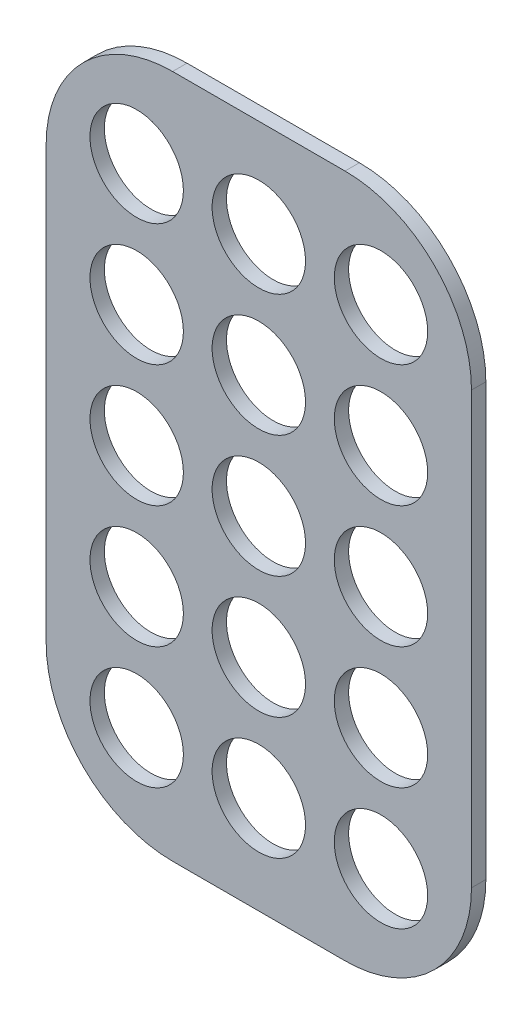
ISO-10303-21;
HEADER;
FILE_DESCRIPTION(('STEP AP214'),'2;1');
FILE_NAME('part.step','',(''),(''),'','','');
FILE_SCHEMA(('AUTOMOTIVE_DESIGN { 1 0 10303 214 1 1 1 1 }'));
ENDSEC;
DATA;
#1=APPLICATION_CONTEXT('core data for automotive mechanical design processes');
#2=APPLICATION_PROTOCOL_DEFINITION('international standard','automotive_design',2000,#1);
#3=PRODUCT_CONTEXT('',#1,'mechanical');
#4=PRODUCT('Part','Part','',(#3));
#5=PRODUCT_RELATED_PRODUCT_CATEGORY('part','',(#4));
#6=PRODUCT_DEFINITION_FORMATION('','',#4);
#7=PRODUCT_DEFINITION_CONTEXT('part definition',#1,'design');
#8=PRODUCT_DEFINITION('design','',#6,#7);
#9=PRODUCT_DEFINITION_SHAPE('','',#8);
#10=(LENGTH_UNIT() NAMED_UNIT(*) SI_UNIT(.MILLI.,.METRE.));
#11=(NAMED_UNIT(*) PLANE_ANGLE_UNIT() SI_UNIT($,.RADIAN.));
#12=(NAMED_UNIT(*) SI_UNIT($,.STERADIAN.) SOLID_ANGLE_UNIT());
#13=UNCERTAINTY_MEASURE_WITH_UNIT(LENGTH_MEASURE(1.E-05),#10,'distance_accuracy_value','');
#14=(GEOMETRIC_REPRESENTATION_CONTEXT(3) GLOBAL_UNCERTAINTY_ASSIGNED_CONTEXT((#13)) GLOBAL_UNIT_ASSIGNED_CONTEXT((#10,
#11,#12)) REPRESENTATION_CONTEXT('',''));
#15=CARTESIAN_POINT('',(0.,0.,0.));
#16=DIRECTION('',(0.,0.,1.));
#17=DIRECTION('',(1.,0.,0.));
#18=AXIS2_PLACEMENT_3D('',#15,#16,#17);
#19=CARTESIAN_POINT('',(-59.2,-47.6,2.));
#20=DIRECTION('',(0.,1.,0.));
#21=DIRECTION('',(-1.,0.,0.));
#22=AXIS2_PLACEMENT_3D('',#19,#20,#21);
#23=PLANE('',#22);
#24=DIRECTION('',(1.,0.,0.));
#25=VECTOR('',#24,1.);
#26=CARTESIAN_POINT('',(-59.2,-47.6,2.));
#27=LINE('',#26,#25);
#28=CARTESIAN_POINT('',(-41.6,-47.6,2.));
#29=VERTEX_POINT('',#28);
#30=CARTESIAN_POINT('',(-17.6,-47.6,2.));
#31=VERTEX_POINT('',#30);
#32=EDGE_CURVE('E125',#29,#31,#27,.T.);
#33=ORIENTED_EDGE('',*,*,#32,.F.);
#34=DIRECTION('',(0.,0.,-1.));
#35=VECTOR('',#34,1.);
#36=CARTESIAN_POINT('',(-41.6,-47.6,2.));
#37=LINE('',#36,#35);
#38=CARTESIAN_POINT('',(-41.6,-47.6,0.));
#39=VERTEX_POINT('',#38);
#40=EDGE_CURVE('E110',#29,#39,#37,.T.);
#41=ORIENTED_EDGE('',*,*,#40,.T.);
#42=DIRECTION('',(1.,0.,0.));
#43=VECTOR('',#42,1.);
#44=CARTESIAN_POINT('',(-59.2,-47.6,0.));
#45=LINE('',#44,#43);
#46=CARTESIAN_POINT('',(-17.6,-47.6,0.));
#47=VERTEX_POINT('',#46);
#48=EDGE_CURVE('E122',#39,#47,#45,.T.);
#49=ORIENTED_EDGE('',*,*,#48,.T.);
#50=DIRECTION('',(0.,0.,-1.));
#51=VECTOR('',#50,1.);
#52=CARTESIAN_POINT('',(-17.6,-47.6,2.));
#53=LINE('',#52,#51);
#54=EDGE_CURVE('E127',#47,#31,#53,.F.);
#55=ORIENTED_EDGE('',*,*,#54,.T.);
#56=EDGE_LOOP('',(#33,#41,#49,#55));
#57=FACE_BOUND('',#56,.T.);
#58=ADVANCED_FACE('F41',(#57),#23,.F.);
#59=CARTESIAN_POINT('',(0.,-47.6,2.));
#60=DIRECTION('',(-1.,0.,0.));
#61=DIRECTION('',(0.,0.,1.));
#62=AXIS2_PLACEMENT_3D('',#59,#60,#61);
#63=PLANE('',#62);
#64=DIRECTION('',(0.,1.,0.));
#65=VECTOR('',#64,1.);
#66=CARTESIAN_POINT('',(0.,-47.6,2.));
#67=LINE('',#66,#65);
#68=CARTESIAN_POINT('',(0.,-30.,2.));
#69=VERTEX_POINT('',#68);
#70=CARTESIAN_POINT('',(0.,30.,2.));
#71=VERTEX_POINT('',#70);
#72=EDGE_CURVE('E180',#69,#71,#67,.T.);
#73=ORIENTED_EDGE('',*,*,#72,.F.);
#74=DIRECTION('',(0.,0.,-1.));
#75=VECTOR('',#74,1.);
#76=CARTESIAN_POINT('',(0.,-30.,2.));
#77=LINE('',#76,#75);
#78=CARTESIAN_POINT('',(0.,-30.,0.));
#79=VERTEX_POINT('',#78);
#80=EDGE_CURVE('E164',#69,#79,#77,.T.);
#81=ORIENTED_EDGE('',*,*,#80,.T.);
#82=DIRECTION('',(0.,1.,0.));
#83=VECTOR('',#82,1.);
#84=CARTESIAN_POINT('',(0.,-47.6,0.));
#85=LINE('',#84,#83);
#86=CARTESIAN_POINT('',(0.,30.,0.));
#87=VERTEX_POINT('',#86);
#88=EDGE_CURVE('E131',#79,#87,#85,.T.);
#89=ORIENTED_EDGE('',*,*,#88,.T.);
#90=DIRECTION('',(0.,0.,-1.));
#91=VECTOR('',#90,1.);
#92=CARTESIAN_POINT('',(0.,30.,2.));
#93=LINE('',#92,#91);
#94=EDGE_CURVE('E162',#87,#71,#93,.F.);
#95=ORIENTED_EDGE('',*,*,#94,.T.);
#96=EDGE_LOOP('',(#73,#81,#89,#95));
#97=FACE_BOUND('',#96,.T.);
#98=ADVANCED_FACE('F290',(#97),#63,.F.);
#99=CARTESIAN_POINT('',(-59.2,47.6,2.));
#100=DIRECTION('',(0.,-1.,0.));
#101=DIRECTION('',(1.,0.,0.));
#102=AXIS2_PLACEMENT_3D('',#99,#100,#101);
#103=PLANE('',#102);
#104=DIRECTION('',(-1.,0.,0.));
#105=VECTOR('',#104,1.);
#106=CARTESIAN_POINT('',(-59.2,47.6,0.));
#107=LINE('',#106,#105);
#108=CARTESIAN_POINT('',(-17.6,47.6,0.));
#109=VERTEX_POINT('',#108);
#110=CARTESIAN_POINT('',(-41.6,47.6,0.));
#111=VERTEX_POINT('',#110);
#112=EDGE_CURVE('E135',#109,#111,#107,.T.);
#113=ORIENTED_EDGE('',*,*,#112,.T.);
#114=DIRECTION('',(0.,0.,-1.));
#115=VECTOR('',#114,1.);
#116=CARTESIAN_POINT('',(-41.6,47.6,2.));
#117=LINE('',#116,#115);
#118=CARTESIAN_POINT('',(-41.6,47.6,2.));
#119=VERTEX_POINT('',#118);
#120=EDGE_CURVE('E11',#111,#119,#117,.F.);
#121=ORIENTED_EDGE('',*,*,#120,.T.);
#122=DIRECTION('',(-1.,0.,0.));
#123=VECTOR('',#122,1.);
#124=CARTESIAN_POINT('',(-59.2,47.6,2.));
#125=LINE('',#124,#123);
#126=CARTESIAN_POINT('',(-17.6,47.6,2.));
#127=VERTEX_POINT('',#126);
#128=EDGE_CURVE('E170',#127,#119,#125,.T.);
#129=ORIENTED_EDGE('',*,*,#128,.F.);
#130=DIRECTION('',(0.,0.,-1.));
#131=VECTOR('',#130,1.);
#132=CARTESIAN_POINT('',(-17.6,47.6,2.));
#133=LINE('',#132,#131);
#134=EDGE_CURVE('E49',#127,#109,#133,.T.);
#135=ORIENTED_EDGE('',*,*,#134,.T.);
#136=EDGE_LOOP('',(#113,#121,#129,#135));
#137=FACE_BOUND('',#136,.T.);
#138=ADVANCED_FACE('F169',(#137),#103,.F.);
#139=CARTESIAN_POINT('',(-59.2,-47.6,2.));
#140=DIRECTION('',(1.,0.,0.));
#141=DIRECTION('',(0.,0.,-1.));
#142=AXIS2_PLACEMENT_3D('',#139,#140,#141);
#143=PLANE('',#142);
#144=DIRECTION('',(0.,-1.,0.));
#145=VECTOR('',#144,1.);
#146=CARTESIAN_POINT('',(-59.2,-47.6,0.));
#147=LINE('',#146,#145);
#148=CARTESIAN_POINT('',(-59.2,30.,0.));
#149=VERTEX_POINT('',#148);
#150=CARTESIAN_POINT('',(-59.2,-30.,0.));
#151=VERTEX_POINT('',#150);
#152=EDGE_CURVE('E145',#149,#151,#147,.T.);
#153=ORIENTED_EDGE('',*,*,#152,.T.);
#154=DIRECTION('',(0.,0.,-1.));
#155=VECTOR('',#154,1.);
#156=CARTESIAN_POINT('',(-59.2,-30.,2.));
#157=LINE('',#156,#155);
#158=CARTESIAN_POINT('',(-59.2,-30.,2.));
#159=VERTEX_POINT('',#158);
#160=EDGE_CURVE('E111',#151,#159,#157,.F.);
#161=ORIENTED_EDGE('',*,*,#160,.T.);
#162=DIRECTION('',(0.,-1.,0.));
#163=VECTOR('',#162,1.);
#164=CARTESIAN_POINT('',(-59.2,-47.6,2.));
#165=LINE('',#164,#163);
#166=CARTESIAN_POINT('',(-59.2,30.,2.));
#167=VERTEX_POINT('',#166);
#168=EDGE_CURVE('E141',#167,#159,#165,.T.);
#169=ORIENTED_EDGE('',*,*,#168,.F.);
#170=DIRECTION('',(0.,0.,-1.));
#171=VECTOR('',#170,1.);
#172=CARTESIAN_POINT('',(-59.2,30.,2.));
#173=LINE('',#172,#171);
#174=EDGE_CURVE('E116',#167,#149,#173,.T.);
#175=ORIENTED_EDGE('',*,*,#174,.T.);
#176=EDGE_LOOP('',(#153,#161,#169,#175));
#177=FACE_BOUND('',#176,.T.);
#178=ADVANCED_FACE('F178',(#177),#143,.F.);
#179=CARTESIAN_POINT('',(0.,0.,2.));
#180=DIRECTION('',(0.,0.,1.));
#181=DIRECTION('',(1.,0.,0.));
#182=AXIS2_PLACEMENT_3D('',#179,#180,#181);
#183=PLANE('',#182);
#184=CARTESIAN_POINT('',(-29.6000000000001,34.,2.));
#185=DIRECTION('',(0.,0.,1.));
#186=DIRECTION('',(1.,0.,0.));
#187=AXIS2_PLACEMENT_3D('',#184,#185,#186);
#188=CIRCLE('',#187,6.5);
#189=CARTESIAN_POINT('',(-23.1000000000001,34.,2.));
#190=VERTEX_POINT('',#189);
#191=EDGE_CURVE('E132',#190,#190,#188,.T.);
#192=ORIENTED_EDGE('',*,*,#191,.F.);
#193=EDGE_LOOP('',(#192));
#194=FACE_BOUND('',#193,.T.);
#195=CARTESIAN_POINT('',(-12.6000000000001,17.,2.));
#196=DIRECTION('',(0.,0.,1.));
#197=DIRECTION('',(1.,0.,0.));
#198=AXIS2_PLACEMENT_3D('',#195,#196,#197);
#199=CIRCLE('',#198,6.5);
#200=CARTESIAN_POINT('',(-6.10000000000006,17.,2.));
#201=VERTEX_POINT('',#200);
#202=EDGE_CURVE('E138',#201,#201,#199,.T.);
#203=ORIENTED_EDGE('',*,*,#202,.F.);
#204=EDGE_LOOP('',(#203));
#205=FACE_BOUND('',#204,.T.);
#206=CARTESIAN_POINT('',(-46.6000000000001,16.9999999999999,2.));
#207=DIRECTION('',(0.,0.,1.));
#208=DIRECTION('',(1.,0.,0.));
#209=AXIS2_PLACEMENT_3D('',#206,#207,#208);
#210=CIRCLE('',#209,6.5);
#211=CARTESIAN_POINT('',(-40.1000000000001,16.9999999999999,2.));
#212=VERTEX_POINT('',#211);
#213=EDGE_CURVE('E186',#212,#212,#210,.T.);
#214=ORIENTED_EDGE('',*,*,#213,.F.);
#215=EDGE_LOOP('',(#214));
#216=FACE_BOUND('',#215,.T.);
#217=CARTESIAN_POINT('',(-29.6000000000001,17.,2.));
#218=DIRECTION('',(0.,0.,1.));
#219=DIRECTION('',(1.,0.,0.));
#220=AXIS2_PLACEMENT_3D('',#217,#218,#219);
#221=CIRCLE('',#220,6.5);
#222=CARTESIAN_POINT('',(-23.1000000000001,17.,2.));
#223=VERTEX_POINT('',#222);
#224=EDGE_CURVE('E189',#223,#223,#221,.T.);
#225=ORIENTED_EDGE('',*,*,#224,.F.);
#226=EDGE_LOOP('',(#225));
#227=FACE_BOUND('',#226,.T.);
#228=CARTESIAN_POINT('',(-46.6000000000001,33.9999999999999,2.));
#229=DIRECTION('',(0.,0.,1.));
#230=DIRECTION('',(1.,0.,0.));
#231=AXIS2_PLACEMENT_3D('',#228,#229,#230);
#232=CIRCLE('',#231,6.5);
#233=CARTESIAN_POINT('',(-40.1000000000001,33.9999999999999,2.));
#234=VERTEX_POINT('',#233);
#235=EDGE_CURVE('E192',#234,#234,#232,.T.);
#236=ORIENTED_EDGE('',*,*,#235,.F.);
#237=EDGE_LOOP('',(#236));
#238=FACE_BOUND('',#237,.T.);
#239=CARTESIAN_POINT('',(-12.6000000000001,34.,2.));
#240=DIRECTION('',(0.,0.,1.));
#241=DIRECTION('',(1.,0.,0.));
#242=AXIS2_PLACEMENT_3D('',#239,#240,#241);
#243=CIRCLE('',#242,6.5);
#244=CARTESIAN_POINT('',(-6.10000000000012,34.,2.));
#245=VERTEX_POINT('',#244);
#246=EDGE_CURVE('E195',#245,#245,#243,.T.);
#247=ORIENTED_EDGE('',*,*,#246,.F.);
#248=EDGE_LOOP('',(#247));
#249=FACE_BOUND('',#248,.T.);
#250=CARTESIAN_POINT('',(-46.6,-1.17961196366423E-13,2.));
#251=DIRECTION('',(0.,0.,1.));
#252=DIRECTION('',(1.,0.,0.));
#253=AXIS2_PLACEMENT_3D('',#250,#251,#252);
#254=CIRCLE('',#253,6.5);
#255=CARTESIAN_POINT('',(-40.1,-1.17961196366423E-13,2.));
#256=VERTEX_POINT('',#255);
#257=EDGE_CURVE('E198',#256,#256,#254,.T.);
#258=ORIENTED_EDGE('',*,*,#257,.F.);
#259=EDGE_LOOP('',(#258));
#260=FACE_BOUND('',#259,.T.);
#261=CARTESIAN_POINT('',(-12.6,0.,2.));
#262=DIRECTION('',(0.,0.,1.));
#263=DIRECTION('',(1.,0.,0.));
#264=AXIS2_PLACEMENT_3D('',#261,#262,#263);
#265=CIRCLE('',#264,6.5);
#266=CARTESIAN_POINT('',(-6.1,0.,2.));
#267=VERTEX_POINT('',#266);
#268=EDGE_CURVE('E201',#267,#267,#265,.T.);
#269=ORIENTED_EDGE('',*,*,#268,.F.);
#270=EDGE_LOOP('',(#269));
#271=FACE_BOUND('',#270,.T.);
#272=CARTESIAN_POINT('',(-29.5999999999998,-17.,2.));
#273=DIRECTION('',(0.,0.,1.));
#274=DIRECTION('',(1.,0.,0.));
#275=AXIS2_PLACEMENT_3D('',#272,#273,#274);
#276=CIRCLE('',#275,6.5);
#277=CARTESIAN_POINT('',(-23.0999999999998,-17.,2.));
#278=VERTEX_POINT('',#277);
#279=EDGE_CURVE('E204',#278,#278,#276,.T.);
#280=ORIENTED_EDGE('',*,*,#279,.F.);
#281=EDGE_LOOP('',(#280));
#282=FACE_BOUND('',#281,.T.);
#283=CARTESIAN_POINT('',(-46.5999999999998,-17.0000000000001,2.));
#284=DIRECTION('',(0.,0.,1.));
#285=DIRECTION('',(1.,0.,0.));
#286=AXIS2_PLACEMENT_3D('',#283,#284,#285);
#287=CIRCLE('',#286,6.5);
#288=CARTESIAN_POINT('',(-40.0999999999998,-17.0000000000001,2.));
#289=VERTEX_POINT('',#288);
#290=EDGE_CURVE('E207',#289,#289,#287,.T.);
#291=ORIENTED_EDGE('',*,*,#290,.F.);
#292=EDGE_LOOP('',(#291));
#293=FACE_BOUND('',#292,.T.);
#294=CARTESIAN_POINT('',(-12.5999999999996,-34.,2.));
#295=DIRECTION('',(0.,0.,1.));
#296=DIRECTION('',(1.,0.,0.));
#297=AXIS2_PLACEMENT_3D('',#294,#295,#296);
#298=CIRCLE('',#297,6.5);
#299=CARTESIAN_POINT('',(-6.09999999999965,-34.,2.));
#300=VERTEX_POINT('',#299);
#301=EDGE_CURVE('E210',#300,#300,#298,.T.);
#302=ORIENTED_EDGE('',*,*,#301,.F.);
#303=EDGE_LOOP('',(#302));
#304=FACE_BOUND('',#303,.T.);
#305=CARTESIAN_POINT('',(-46.5999999999996,-34.0000000000001,2.));
#306=DIRECTION('',(0.,0.,1.));
#307=DIRECTION('',(1.,0.,0.));
#308=AXIS2_PLACEMENT_3D('',#305,#306,#307);
#309=CIRCLE('',#308,6.5);
#310=CARTESIAN_POINT('',(-40.0999999999997,-34.0000000000001,2.));
#311=VERTEX_POINT('',#310);
#312=EDGE_CURVE('E213',#311,#311,#309,.T.);
#313=ORIENTED_EDGE('',*,*,#312,.F.);
#314=EDGE_LOOP('',(#313));
#315=FACE_BOUND('',#314,.T.);
#316=CARTESIAN_POINT('',(-29.5999999999996,-34.,2.));
#317=DIRECTION('',(0.,0.,1.));
#318=DIRECTION('',(1.,0.,0.));
#319=AXIS2_PLACEMENT_3D('',#316,#317,#318);
#320=CIRCLE('',#319,6.5);
#321=CARTESIAN_POINT('',(-23.0999999999996,-34.,2.));
#322=VERTEX_POINT('',#321);
#323=EDGE_CURVE('E216',#322,#322,#320,.T.);
#324=ORIENTED_EDGE('',*,*,#323,.F.);
#325=EDGE_LOOP('',(#324));
#326=FACE_BOUND('',#325,.T.);
#327=CARTESIAN_POINT('',(-12.5999999999998,-17.,2.));
#328=DIRECTION('',(0.,0.,1.));
#329=DIRECTION('',(1.,0.,0.));
#330=AXIS2_PLACEMENT_3D('',#327,#328,#329);
#331=CIRCLE('',#330,6.5);
#332=CARTESIAN_POINT('',(-6.09999999999982,-17.,2.));
#333=VERTEX_POINT('',#332);
#334=EDGE_CURVE('E219',#333,#333,#331,.T.);
#335=ORIENTED_EDGE('',*,*,#334,.F.);
#336=EDGE_LOOP('',(#335));
#337=FACE_BOUND('',#336,.T.);
#338=CARTESIAN_POINT('',(-29.6,0.,2.));
#339=DIRECTION('',(0.,0.,1.));
#340=DIRECTION('',(1.,0.,0.));
#341=AXIS2_PLACEMENT_3D('',#338,#339,#340);
#342=CIRCLE('',#341,6.5);
#343=CARTESIAN_POINT('',(-23.1,0.,2.));
#344=VERTEX_POINT('',#343);
#345=EDGE_CURVE('E222',#344,#344,#342,.T.);
#346=ORIENTED_EDGE('',*,*,#345,.F.);
#347=EDGE_LOOP('',(#346));
#348=FACE_BOUND('',#347,.T.);
#349=ORIENTED_EDGE('',*,*,#168,.T.);
#350=CARTESIAN_POINT('',(-41.6,-30.,2.));
#351=DIRECTION('',(0.,0.,1.));
#352=DIRECTION('',(1.,0.,0.));
#353=AXIS2_PLACEMENT_3D('',#350,#351,#352);
#354=CIRCLE('',#353,17.6);
#355=EDGE_CURVE('E160',#159,#29,#354,.T.);
#356=ORIENTED_EDGE('',*,*,#355,.T.);
#357=ORIENTED_EDGE('',*,*,#32,.T.);
#358=CARTESIAN_POINT('',(-17.6,-30.,2.));
#359=DIRECTION('',(0.,0.,1.));
#360=DIRECTION('',(1.,0.,0.));
#361=AXIS2_PLACEMENT_3D('',#358,#359,#360);
#362=CIRCLE('',#361,17.6);
#363=EDGE_CURVE('E158',#31,#69,#362,.T.);
#364=ORIENTED_EDGE('',*,*,#363,.T.);
#365=ORIENTED_EDGE('',*,*,#72,.T.);
#366=CARTESIAN_POINT('',(-17.6,30.,2.));
#367=DIRECTION('',(0.,0.,1.));
#368=DIRECTION('',(1.,0.,0.));
#369=AXIS2_PLACEMENT_3D('',#366,#367,#368);
#370=CIRCLE('',#369,17.6);
#371=EDGE_CURVE('E61',#71,#127,#370,.T.);
#372=ORIENTED_EDGE('',*,*,#371,.T.);
#373=ORIENTED_EDGE('',*,*,#128,.T.);
#374=CARTESIAN_POINT('',(-41.6,30.,2.));
#375=DIRECTION('',(0.,0.,1.));
#376=DIRECTION('',(1.,0.,0.));
#377=AXIS2_PLACEMENT_3D('',#374,#375,#376);
#378=CIRCLE('',#377,17.6);
#379=EDGE_CURVE('E156',#119,#167,#378,.T.);
#380=ORIENTED_EDGE('',*,*,#379,.T.);
#381=EDGE_LOOP('',(#349,#356,#357,#364,#365,#372,#373,#380));
#382=FACE_BOUND('',#381,.T.);
#383=ADVANCED_FACE('F315',(#194,#205,#216,#227,#238,#249,#260,#271,#282,#293,#304,#315,#326,
#337,#348,#382),#183,.T.);
#384=CARTESIAN_POINT('',(0.,0.,0.));
#385=DIRECTION('',(0.,0.,1.));
#386=DIRECTION('',(1.,0.,0.));
#387=AXIS2_PLACEMENT_3D('',#384,#385,#386);
#388=PLANE('',#387);
#389=CARTESIAN_POINT('',(-29.6000000000001,34.,0.));
#390=DIRECTION('',(0.,0.,1.));
#391=DIRECTION('',(1.,0.,0.));
#392=AXIS2_PLACEMENT_3D('',#389,#390,#391);
#393=CIRCLE('',#392,6.5);
#394=CARTESIAN_POINT('',(-23.1000000000001,34.,0.));
#395=VERTEX_POINT('',#394);
#396=EDGE_CURVE('E237',#395,#395,#393,.T.);
#397=ORIENTED_EDGE('',*,*,#396,.T.);
#398=EDGE_LOOP('',(#397));
#399=FACE_BOUND('',#398,.T.);
#400=CARTESIAN_POINT('',(-12.6000000000001,17.,0.));
#401=DIRECTION('',(0.,0.,1.));
#402=DIRECTION('',(1.,0.,0.));
#403=AXIS2_PLACEMENT_3D('',#400,#401,#402);
#404=CIRCLE('',#403,6.5);
#405=CARTESIAN_POINT('',(-6.10000000000006,17.,0.));
#406=VERTEX_POINT('',#405);
#407=EDGE_CURVE('E233',#406,#406,#404,.T.);
#408=ORIENTED_EDGE('',*,*,#407,.T.);
#409=EDGE_LOOP('',(#408));
#410=FACE_BOUND('',#409,.T.);
#411=CARTESIAN_POINT('',(-46.6000000000001,16.9999999999999,0.));
#412=DIRECTION('',(0.,0.,1.));
#413=DIRECTION('',(1.,0.,0.));
#414=AXIS2_PLACEMENT_3D('',#411,#412,#413);
#415=CIRCLE('',#414,6.5);
#416=CARTESIAN_POINT('',(-40.1000000000001,16.9999999999999,0.));
#417=VERTEX_POINT('',#416);
#418=EDGE_CURVE('E229',#417,#417,#415,.T.);
#419=ORIENTED_EDGE('',*,*,#418,.T.);
#420=EDGE_LOOP('',(#419));
#421=FACE_BOUND('',#420,.T.);
#422=CARTESIAN_POINT('',(-29.6000000000001,17.,0.));
#423=DIRECTION('',(0.,0.,1.));
#424=DIRECTION('',(1.,0.,0.));
#425=AXIS2_PLACEMENT_3D('',#422,#423,#424);
#426=CIRCLE('',#425,6.5);
#427=CARTESIAN_POINT('',(-23.1000000000001,17.,0.));
#428=VERTEX_POINT('',#427);
#429=EDGE_CURVE('E232',#428,#428,#426,.T.);
#430=ORIENTED_EDGE('',*,*,#429,.T.);
#431=EDGE_LOOP('',(#430));
#432=FACE_BOUND('',#431,.T.);
#433=CARTESIAN_POINT('',(-46.6000000000001,33.9999999999999,0.));
#434=DIRECTION('',(0.,0.,1.));
#435=DIRECTION('',(1.,0.,0.));
#436=AXIS2_PLACEMENT_3D('',#433,#434,#435);
#437=CIRCLE('',#436,6.5);
#438=CARTESIAN_POINT('',(-40.1000000000001,33.9999999999999,0.));
#439=VERTEX_POINT('',#438);
#440=EDGE_CURVE('E240',#439,#439,#437,.T.);
#441=ORIENTED_EDGE('',*,*,#440,.T.);
#442=EDGE_LOOP('',(#441));
#443=FACE_BOUND('',#442,.T.);
#444=CARTESIAN_POINT('',(-12.6000000000001,34.,0.));
#445=DIRECTION('',(0.,0.,1.));
#446=DIRECTION('',(1.,0.,0.));
#447=AXIS2_PLACEMENT_3D('',#444,#445,#446);
#448=CIRCLE('',#447,6.5);
#449=CARTESIAN_POINT('',(-6.10000000000012,34.,0.));
#450=VERTEX_POINT('',#449);
#451=EDGE_CURVE('E243',#450,#450,#448,.T.);
#452=ORIENTED_EDGE('',*,*,#451,.T.);
#453=EDGE_LOOP('',(#452));
#454=FACE_BOUND('',#453,.T.);
#455=CARTESIAN_POINT('',(-46.6,-1.17961196366423E-13,0.));
#456=DIRECTION('',(0.,0.,1.));
#457=DIRECTION('',(1.,0.,0.));
#458=AXIS2_PLACEMENT_3D('',#455,#456,#457);
#459=CIRCLE('',#458,6.5);
#460=CARTESIAN_POINT('',(-40.1,-1.17961196366423E-13,0.));
#461=VERTEX_POINT('',#460);
#462=EDGE_CURVE('E228',#461,#461,#459,.T.);
#463=ORIENTED_EDGE('',*,*,#462,.T.);
#464=EDGE_LOOP('',(#463));
#465=FACE_BOUND('',#464,.T.);
#466=CARTESIAN_POINT('',(-12.6,0.,0.));
#467=DIRECTION('',(0.,0.,1.));
#468=DIRECTION('',(1.,0.,0.));
#469=AXIS2_PLACEMENT_3D('',#466,#467,#468);
#470=CIRCLE('',#469,6.5);
#471=CARTESIAN_POINT('',(-6.1,0.,0.));
#472=VERTEX_POINT('',#471);
#473=EDGE_CURVE('E255',#472,#472,#470,.T.);
#474=ORIENTED_EDGE('',*,*,#473,.T.);
#475=EDGE_LOOP('',(#474));
#476=FACE_BOUND('',#475,.T.);
#477=CARTESIAN_POINT('',(-29.5999999999998,-17.,0.));
#478=DIRECTION('',(0.,0.,1.));
#479=DIRECTION('',(1.,0.,0.));
#480=AXIS2_PLACEMENT_3D('',#477,#478,#479);
#481=CIRCLE('',#480,6.5);
#482=CARTESIAN_POINT('',(-23.0999999999998,-17.,0.));
#483=VERTEX_POINT('',#482);
#484=EDGE_CURVE('E251',#483,#483,#481,.T.);
#485=ORIENTED_EDGE('',*,*,#484,.T.);
#486=EDGE_LOOP('',(#485));
#487=FACE_BOUND('',#486,.T.);
#488=CARTESIAN_POINT('',(-46.5999999999998,-17.0000000000001,0.));
#489=DIRECTION('',(0.,0.,1.));
#490=DIRECTION('',(1.,0.,0.));
#491=AXIS2_PLACEMENT_3D('',#488,#489,#490);
#492=CIRCLE('',#491,6.5);
#493=CARTESIAN_POINT('',(-40.0999999999998,-17.0000000000001,0.));
#494=VERTEX_POINT('',#493);
#495=EDGE_CURVE('E248',#494,#494,#492,.T.);
#496=ORIENTED_EDGE('',*,*,#495,.T.);
#497=EDGE_LOOP('',(#496));
#498=FACE_BOUND('',#497,.T.);
#499=CARTESIAN_POINT('',(-12.5999999999996,-34.,0.));
#500=DIRECTION('',(0.,0.,1.));
#501=DIRECTION('',(1.,0.,0.));
#502=AXIS2_PLACEMENT_3D('',#499,#500,#501);
#503=CIRCLE('',#502,6.5);
#504=CARTESIAN_POINT('',(-6.09999999999965,-34.,0.));
#505=VERTEX_POINT('',#504);
#506=EDGE_CURVE('E236',#505,#505,#503,.T.);
#507=ORIENTED_EDGE('',*,*,#506,.T.);
#508=EDGE_LOOP('',(#507));
#509=FACE_BOUND('',#508,.T.);
#510=CARTESIAN_POINT('',(-46.5999999999996,-34.0000000000001,0.));
#511=DIRECTION('',(0.,0.,1.));
#512=DIRECTION('',(1.,0.,0.));
#513=AXIS2_PLACEMENT_3D('',#510,#511,#512);
#514=CIRCLE('',#513,6.5);
#515=CARTESIAN_POINT('',(-40.0999999999997,-34.0000000000001,0.));
#516=VERTEX_POINT('',#515);
#517=EDGE_CURVE('E263',#516,#516,#514,.T.);
#518=ORIENTED_EDGE('',*,*,#517,.T.);
#519=EDGE_LOOP('',(#518));
#520=FACE_BOUND('',#519,.T.);
#521=CARTESIAN_POINT('',(-29.5999999999996,-34.,0.));
#522=DIRECTION('',(0.,0.,1.));
#523=DIRECTION('',(1.,0.,0.));
#524=AXIS2_PLACEMENT_3D('',#521,#522,#523);
#525=CIRCLE('',#524,6.5);
#526=CARTESIAN_POINT('',(-23.0999999999996,-34.,0.));
#527=VERTEX_POINT('',#526);
#528=EDGE_CURVE('E260',#527,#527,#525,.T.);
#529=ORIENTED_EDGE('',*,*,#528,.T.);
#530=EDGE_LOOP('',(#529));
#531=FACE_BOUND('',#530,.T.);
#532=CARTESIAN_POINT('',(-12.5999999999998,-17.,0.));
#533=DIRECTION('',(0.,0.,1.));
#534=DIRECTION('',(1.,0.,0.));
#535=AXIS2_PLACEMENT_3D('',#532,#533,#534);
#536=CIRCLE('',#535,6.5);
#537=CARTESIAN_POINT('',(-6.09999999999982,-17.,0.));
#538=VERTEX_POINT('',#537);
#539=EDGE_CURVE('E252',#538,#538,#536,.T.);
#540=ORIENTED_EDGE('',*,*,#539,.T.);
#541=EDGE_LOOP('',(#540));
#542=FACE_BOUND('',#541,.T.);
#543=CARTESIAN_POINT('',(-29.6,0.,0.));
#544=DIRECTION('',(0.,0.,1.));
#545=DIRECTION('',(1.,0.,0.));
#546=AXIS2_PLACEMENT_3D('',#543,#544,#545);
#547=CIRCLE('',#546,6.5);
#548=CARTESIAN_POINT('',(-23.1,0.,0.));
#549=VERTEX_POINT('',#548);
#550=EDGE_CURVE('E225',#549,#549,#547,.T.);
#551=ORIENTED_EDGE('',*,*,#550,.T.);
#552=EDGE_LOOP('',(#551));
#553=FACE_BOUND('',#552,.T.);
#554=ORIENTED_EDGE('',*,*,#48,.F.);
#555=CARTESIAN_POINT('',(-41.6,-30.,0.));
#556=DIRECTION('',(0.,0.,1.));
#557=DIRECTION('',(1.,0.,0.));
#558=AXIS2_PLACEMENT_3D('',#555,#556,#557);
#559=CIRCLE('',#558,17.6);
#560=EDGE_CURVE('E106',#39,#151,#559,.F.);
#561=ORIENTED_EDGE('',*,*,#560,.T.);
#562=ORIENTED_EDGE('',*,*,#152,.F.);
#563=CARTESIAN_POINT('',(-41.6,30.,0.));
#564=DIRECTION('',(0.,0.,1.));
#565=DIRECTION('',(1.,0.,0.));
#566=AXIS2_PLACEMENT_3D('',#563,#564,#565);
#567=CIRCLE('',#566,17.6);
#568=EDGE_CURVE('E149',#149,#111,#567,.F.);
#569=ORIENTED_EDGE('',*,*,#568,.T.);
#570=ORIENTED_EDGE('',*,*,#112,.F.);
#571=CARTESIAN_POINT('',(-17.6,30.,0.));
#572=DIRECTION('',(0.,0.,1.));
#573=DIRECTION('',(1.,0.,0.));
#574=AXIS2_PLACEMENT_3D('',#571,#572,#573);
#575=CIRCLE('',#574,17.6);
#576=EDGE_CURVE('E126',#109,#87,#575,.F.);
#577=ORIENTED_EDGE('',*,*,#576,.T.);
#578=ORIENTED_EDGE('',*,*,#88,.F.);
#579=CARTESIAN_POINT('',(-17.6,-30.,0.));
#580=DIRECTION('',(0.,0.,1.));
#581=DIRECTION('',(1.,0.,0.));
#582=AXIS2_PLACEMENT_3D('',#579,#580,#581);
#583=CIRCLE('',#582,17.6);
#584=EDGE_CURVE('E117',#79,#47,#583,.F.);
#585=ORIENTED_EDGE('',*,*,#584,.T.);
#586=EDGE_LOOP('',(#554,#561,#562,#569,#570,#577,#578,#585));
#587=FACE_BOUND('',#586,.T.);
#588=ADVANCED_FACE('F129',(#399,#410,#421,#432,#443,#454,#465,#476,#487,#498,#509,#520,#531,
#542,#553,#587),#388,.F.);
#589=CARTESIAN_POINT('',(-29.6,0.,0.));
#590=DIRECTION('',(0.,0.,1.));
#591=DIRECTION('',(1.,0.,0.));
#592=AXIS2_PLACEMENT_3D('',#589,#590,#591);
#593=CYLINDRICAL_SURFACE('',#592,6.5);
#594=ORIENTED_EDGE('',*,*,#345,.T.);
#595=EDGE_LOOP('',(#594));
#596=FACE_BOUND('',#595,.T.);
#597=ORIENTED_EDGE('',*,*,#550,.F.);
#598=EDGE_LOOP('',(#597));
#599=FACE_BOUND('',#598,.T.);
#600=ADVANCED_FACE('F324',(#596,#599),#593,.F.);
#601=CARTESIAN_POINT('',(-12.5999999999998,-17.,0.));
#602=DIRECTION('',(0.,0.,1.));
#603=DIRECTION('',(1.,0.,0.));
#604=AXIS2_PLACEMENT_3D('',#601,#602,#603);
#605=CYLINDRICAL_SURFACE('',#604,6.5);
#606=ORIENTED_EDGE('',*,*,#334,.T.);
#607=EDGE_LOOP('',(#606));
#608=FACE_BOUND('',#607,.T.);
#609=ORIENTED_EDGE('',*,*,#539,.F.);
#610=EDGE_LOOP('',(#609));
#611=FACE_BOUND('',#610,.T.);
#612=ADVANCED_FACE('F286',(#608,#611),#605,.F.);
#613=CARTESIAN_POINT('',(-29.5999999999996,-34.,0.));
#614=DIRECTION('',(0.,0.,1.));
#615=DIRECTION('',(1.,0.,0.));
#616=AXIS2_PLACEMENT_3D('',#613,#614,#615);
#617=CYLINDRICAL_SURFACE('',#616,6.5);
#618=ORIENTED_EDGE('',*,*,#323,.T.);
#619=EDGE_LOOP('',(#618));
#620=FACE_BOUND('',#619,.T.);
#621=ORIENTED_EDGE('',*,*,#528,.F.);
#622=EDGE_LOOP('',(#621));
#623=FACE_BOUND('',#622,.T.);
#624=ADVANCED_FACE('F276',(#620,#623),#617,.F.);
#625=CARTESIAN_POINT('',(-46.5999999999996,-34.0000000000001,0.));
#626=DIRECTION('',(0.,0.,1.));
#627=DIRECTION('',(1.,0.,0.));
#628=AXIS2_PLACEMENT_3D('',#625,#626,#627);
#629=CYLINDRICAL_SURFACE('',#628,6.5);
#630=ORIENTED_EDGE('',*,*,#312,.T.);
#631=EDGE_LOOP('',(#630));
#632=FACE_BOUND('',#631,.T.);
#633=ORIENTED_EDGE('',*,*,#517,.F.);
#634=EDGE_LOOP('',(#633));
#635=FACE_BOUND('',#634,.T.);
#636=ADVANCED_FACE('F273',(#632,#635),#629,.F.);
#637=CARTESIAN_POINT('',(-12.5999999999996,-34.,0.));
#638=DIRECTION('',(0.,0.,1.));
#639=DIRECTION('',(1.,0.,0.));
#640=AXIS2_PLACEMENT_3D('',#637,#638,#639);
#641=CYLINDRICAL_SURFACE('',#640,6.5);
#642=ORIENTED_EDGE('',*,*,#301,.T.);
#643=EDGE_LOOP('',(#642));
#644=FACE_BOUND('',#643,.T.);
#645=ORIENTED_EDGE('',*,*,#506,.F.);
#646=EDGE_LOOP('',(#645));
#647=FACE_BOUND('',#646,.T.);
#648=ADVANCED_FACE('F275',(#644,#647),#641,.F.);
#649=CARTESIAN_POINT('',(-46.5999999999998,-17.0000000000001,0.));
#650=DIRECTION('',(0.,0.,1.));
#651=DIRECTION('',(1.,0.,0.));
#652=AXIS2_PLACEMENT_3D('',#649,#650,#651);
#653=CYLINDRICAL_SURFACE('',#652,6.5);
#654=ORIENTED_EDGE('',*,*,#290,.T.);
#655=EDGE_LOOP('',(#654));
#656=FACE_BOUND('',#655,.T.);
#657=ORIENTED_EDGE('',*,*,#495,.F.);
#658=EDGE_LOOP('',(#657));
#659=FACE_BOUND('',#658,.T.);
#660=ADVANCED_FACE('F283',(#656,#659),#653,.F.);
#661=CARTESIAN_POINT('',(-29.5999999999998,-17.,0.));
#662=DIRECTION('',(0.,0.,1.));
#663=DIRECTION('',(1.,0.,0.));
#664=AXIS2_PLACEMENT_3D('',#661,#662,#663);
#665=CYLINDRICAL_SURFACE('',#664,6.5);
#666=ORIENTED_EDGE('',*,*,#279,.T.);
#667=EDGE_LOOP('',(#666));
#668=FACE_BOUND('',#667,.T.);
#669=ORIENTED_EDGE('',*,*,#484,.F.);
#670=EDGE_LOOP('',(#669));
#671=FACE_BOUND('',#670,.T.);
#672=ADVANCED_FACE('F395',(#668,#671),#665,.F.);
#673=CARTESIAN_POINT('',(-12.6,0.,0.));
#674=DIRECTION('',(0.,0.,1.));
#675=DIRECTION('',(1.,0.,0.));
#676=AXIS2_PLACEMENT_3D('',#673,#674,#675);
#677=CYLINDRICAL_SURFACE('',#676,6.5);
#678=ORIENTED_EDGE('',*,*,#268,.T.);
#679=EDGE_LOOP('',(#678));
#680=FACE_BOUND('',#679,.T.);
#681=ORIENTED_EDGE('',*,*,#473,.F.);
#682=EDGE_LOOP('',(#681));
#683=FACE_BOUND('',#682,.T.);
#684=ADVANCED_FACE('F405',(#680,#683),#677,.F.);
#685=CARTESIAN_POINT('',(-46.6,-1.17961196366423E-13,0.));
#686=DIRECTION('',(0.,0.,1.));
#687=DIRECTION('',(1.,0.,0.));
#688=AXIS2_PLACEMENT_3D('',#685,#686,#687);
#689=CYLINDRICAL_SURFACE('',#688,6.5);
#690=ORIENTED_EDGE('',*,*,#257,.T.);
#691=EDGE_LOOP('',(#690));
#692=FACE_BOUND('',#691,.T.);
#693=ORIENTED_EDGE('',*,*,#462,.F.);
#694=EDGE_LOOP('',(#693));
#695=FACE_BOUND('',#694,.T.);
#696=ADVANCED_FACE('F415',(#692,#695),#689,.F.);
#697=CARTESIAN_POINT('',(-12.6000000000001,34.,0.));
#698=DIRECTION('',(0.,0.,1.));
#699=DIRECTION('',(1.,0.,0.));
#700=AXIS2_PLACEMENT_3D('',#697,#698,#699);
#701=CYLINDRICAL_SURFACE('',#700,6.5);
#702=ORIENTED_EDGE('',*,*,#246,.T.);
#703=EDGE_LOOP('',(#702));
#704=FACE_BOUND('',#703,.T.);
#705=ORIENTED_EDGE('',*,*,#451,.F.);
#706=EDGE_LOOP('',(#705));
#707=FACE_BOUND('',#706,.T.);
#708=ADVANCED_FACE('F425',(#704,#707),#701,.F.);
#709=CARTESIAN_POINT('',(-46.6000000000001,33.9999999999999,0.));
#710=DIRECTION('',(0.,0.,1.));
#711=DIRECTION('',(1.,0.,0.));
#712=AXIS2_PLACEMENT_3D('',#709,#710,#711);
#713=CYLINDRICAL_SURFACE('',#712,6.5);
#714=ORIENTED_EDGE('',*,*,#235,.T.);
#715=EDGE_LOOP('',(#714));
#716=FACE_BOUND('',#715,.T.);
#717=ORIENTED_EDGE('',*,*,#440,.F.);
#718=EDGE_LOOP('',(#717));
#719=FACE_BOUND('',#718,.T.);
#720=ADVANCED_FACE('F435',(#716,#719),#713,.F.);
#721=CARTESIAN_POINT('',(-29.6000000000001,17.,0.));
#722=DIRECTION('',(0.,0.,1.));
#723=DIRECTION('',(1.,0.,0.));
#724=AXIS2_PLACEMENT_3D('',#721,#722,#723);
#725=CYLINDRICAL_SURFACE('',#724,6.5);
#726=ORIENTED_EDGE('',*,*,#224,.T.);
#727=EDGE_LOOP('',(#726));
#728=FACE_BOUND('',#727,.T.);
#729=ORIENTED_EDGE('',*,*,#429,.F.);
#730=EDGE_LOOP('',(#729));
#731=FACE_BOUND('',#730,.T.);
#732=ADVANCED_FACE('F445',(#728,#731),#725,.F.);
#733=CARTESIAN_POINT('',(-46.6000000000001,16.9999999999999,0.));
#734=DIRECTION('',(0.,0.,1.));
#735=DIRECTION('',(1.,0.,0.));
#736=AXIS2_PLACEMENT_3D('',#733,#734,#735);
#737=CYLINDRICAL_SURFACE('',#736,6.5);
#738=ORIENTED_EDGE('',*,*,#213,.T.);
#739=EDGE_LOOP('',(#738));
#740=FACE_BOUND('',#739,.T.);
#741=ORIENTED_EDGE('',*,*,#418,.F.);
#742=EDGE_LOOP('',(#741));
#743=FACE_BOUND('',#742,.T.);
#744=ADVANCED_FACE('F455',(#740,#743),#737,.F.);
#745=CARTESIAN_POINT('',(-12.6000000000001,17.,0.));
#746=DIRECTION('',(0.,0.,1.));
#747=DIRECTION('',(1.,0.,0.));
#748=AXIS2_PLACEMENT_3D('',#745,#746,#747);
#749=CYLINDRICAL_SURFACE('',#748,6.5);
#750=ORIENTED_EDGE('',*,*,#202,.T.);
#751=EDGE_LOOP('',(#750));
#752=FACE_BOUND('',#751,.T.);
#753=ORIENTED_EDGE('',*,*,#407,.F.);
#754=EDGE_LOOP('',(#753));
#755=FACE_BOUND('',#754,.T.);
#756=ADVANCED_FACE('F465',(#752,#755),#749,.F.);
#757=CARTESIAN_POINT('',(-29.6000000000001,34.,0.));
#758=DIRECTION('',(0.,0.,1.));
#759=DIRECTION('',(1.,0.,0.));
#760=AXIS2_PLACEMENT_3D('',#757,#758,#759);
#761=CYLINDRICAL_SURFACE('',#760,6.5);
#762=ORIENTED_EDGE('',*,*,#191,.T.);
#763=EDGE_LOOP('',(#762));
#764=FACE_BOUND('',#763,.T.);
#765=ORIENTED_EDGE('',*,*,#396,.F.);
#766=EDGE_LOOP('',(#765));
#767=FACE_BOUND('',#766,.T.);
#768=ADVANCED_FACE('F303',(#764,#767),#761,.F.);
#769=CARTESIAN_POINT('',(-41.6,-30.,2.));
#770=DIRECTION('',(0.,0.,-1.));
#771=DIRECTION('',(-1.,0.,0.));
#772=AXIS2_PLACEMENT_3D('',#769,#770,#771);
#773=CYLINDRICAL_SURFACE('',#772,17.6);
#774=ORIENTED_EDGE('',*,*,#355,.F.);
#775=ORIENTED_EDGE('',*,*,#160,.F.);
#776=ORIENTED_EDGE('',*,*,#560,.F.);
#777=ORIENTED_EDGE('',*,*,#40,.F.);
#778=EDGE_LOOP('',(#774,#775,#776,#777));
#779=FACE_BOUND('',#778,.T.);
#780=ADVANCED_FACE('F109',(#779),#773,.T.);
#781=CARTESIAN_POINT('',(-17.6,-30.,2.));
#782=DIRECTION('',(0.,0.,-1.));
#783=DIRECTION('',(-1.,0.,0.));
#784=AXIS2_PLACEMENT_3D('',#781,#782,#783);
#785=CYLINDRICAL_SURFACE('',#784,17.6);
#786=ORIENTED_EDGE('',*,*,#363,.F.);
#787=ORIENTED_EDGE('',*,*,#54,.F.);
#788=ORIENTED_EDGE('',*,*,#584,.F.);
#789=ORIENTED_EDGE('',*,*,#80,.F.);
#790=EDGE_LOOP('',(#786,#787,#788,#789));
#791=FACE_BOUND('',#790,.T.);
#792=ADVANCED_FACE('F302',(#791),#785,.T.);
#793=CARTESIAN_POINT('',(-41.6,30.,2.));
#794=DIRECTION('',(0.,0.,-1.));
#795=DIRECTION('',(-1.,0.,0.));
#796=AXIS2_PLACEMENT_3D('',#793,#794,#795);
#797=CYLINDRICAL_SURFACE('',#796,17.6);
#798=ORIENTED_EDGE('',*,*,#379,.F.);
#799=ORIENTED_EDGE('',*,*,#120,.F.);
#800=ORIENTED_EDGE('',*,*,#568,.F.);
#801=ORIENTED_EDGE('',*,*,#174,.F.);
#802=EDGE_LOOP('',(#798,#799,#800,#801));
#803=FACE_BOUND('',#802,.T.);
#804=ADVANCED_FACE('F175',(#803),#797,.T.);
#805=CARTESIAN_POINT('',(-17.6,30.,2.));
#806=DIRECTION('',(0.,0.,-1.));
#807=DIRECTION('',(-1.,0.,0.));
#808=AXIS2_PLACEMENT_3D('',#805,#806,#807);
#809=CYLINDRICAL_SURFACE('',#808,17.6);
#810=ORIENTED_EDGE('',*,*,#371,.F.);
#811=ORIENTED_EDGE('',*,*,#94,.F.);
#812=ORIENTED_EDGE('',*,*,#576,.F.);
#813=ORIENTED_EDGE('',*,*,#134,.F.);
#814=EDGE_LOOP('',(#810,#811,#812,#813));
#815=FACE_BOUND('',#814,.T.);
#816=ADVANCED_FACE('F43',(#815),#809,.T.);
#817=CLOSED_SHELL('',(#58,#98,#138,#178,#383,#588,#600,#612,#624,#636,#648,#660,#672,#684,#696,
#708,#720,#732,#744,#756,#768,#780,#792,#804,#816));
#818=MANIFOLD_SOLID_BREP('B2',#817);
#819=ADVANCED_BREP_SHAPE_REPRESENTATION('',(#18,#818),#14);
#820=SHAPE_DEFINITION_REPRESENTATION(#9,#819);
ENDSEC;
END-ISO-10303-21;
